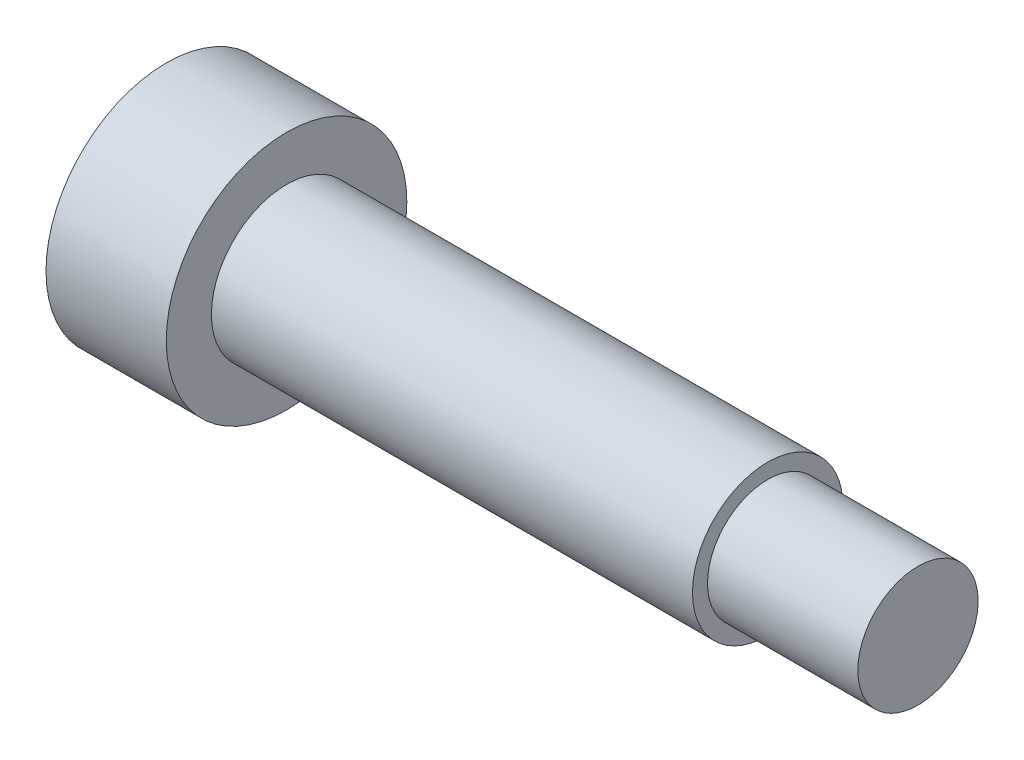
ISO-10303-21;
HEADER;
FILE_DESCRIPTION(('STEP AP214'),'2;1');
FILE_NAME('part.step','',(''),(''),'','','');
FILE_SCHEMA(('AUTOMOTIVE_DESIGN { 1 0 10303 214 1 1 1 1 }'));
ENDSEC;
DATA;
#1=APPLICATION_CONTEXT('core data for automotive mechanical design processes');
#2=APPLICATION_PROTOCOL_DEFINITION('international standard','automotive_design',2000,#1);
#3=PRODUCT_CONTEXT('',#1,'mechanical');
#4=PRODUCT('Part','Part','',(#3));
#5=PRODUCT_RELATED_PRODUCT_CATEGORY('part','',(#4));
#6=PRODUCT_DEFINITION_FORMATION('','',#4);
#7=PRODUCT_DEFINITION_CONTEXT('part definition',#1,'design');
#8=PRODUCT_DEFINITION('design','',#6,#7);
#9=PRODUCT_DEFINITION_SHAPE('','',#8);
#10=(LENGTH_UNIT() NAMED_UNIT(*) SI_UNIT(.MILLI.,.METRE.));
#11=(NAMED_UNIT(*) PLANE_ANGLE_UNIT() SI_UNIT($,.RADIAN.));
#12=(NAMED_UNIT(*) SI_UNIT($,.STERADIAN.) SOLID_ANGLE_UNIT());
#13=UNCERTAINTY_MEASURE_WITH_UNIT(LENGTH_MEASURE(1.E-05),#10,'distance_accuracy_value','');
#14=(GEOMETRIC_REPRESENTATION_CONTEXT(3) GLOBAL_UNCERTAINTY_ASSIGNED_CONTEXT((#13)) GLOBAL_UNIT_ASSIGNED_CONTEXT((#10,
#11,#12)) REPRESENTATION_CONTEXT('',''));
#15=CARTESIAN_POINT('',(0.,0.,0.));
#16=DIRECTION('',(0.,0.,1.));
#17=DIRECTION('',(1.,0.,0.));
#18=AXIS2_PLACEMENT_3D('',#15,#16,#17);
#19=CARTESIAN_POINT('',(0.,4.,0.));
#20=DIRECTION('',(1.,0.,0.));
#21=DIRECTION('',(0.,0.,-1.));
#22=AXIS2_PLACEMENT_3D('',#19,#20,#21);
#23=PLANE('',#22);
#24=DIRECTION('',(0.,-0.620623544845889,-0.784108675875305));
#25=VECTOR('',#24,1.);
#26=CARTESIAN_POINT('',(0.,1.42803230819687,-0.2098977371942));
#27=LINE('',#26,#25);
#28=CARTESIAN_POINT('',(0.,1.42803230819687,-0.2098977371942));
#29=VERTEX_POINT('',#28);
#30=CARTESIAN_POINT('',(0.,0.532239381491389,-1.34166112492052));
#31=VERTEX_POINT('',#30);
#32=EDGE_CURVE('E122',#29,#31,#27,.T.);
#33=ORIENTED_EDGE('',*,*,#32,.F.);
#34=DIRECTION('',(0.,0.368746260212848,-0.929530093960943));
#35=VECTOR('',#34,1.);
#36=CARTESIAN_POINT('',(0.,0.895792926705485,1.13176338772632));
#37=LINE('',#36,#35);
#38=CARTESIAN_POINT('',(0.,0.895792926705485,1.13176338772632));
#39=VERTEX_POINT('',#38);
#40=EDGE_CURVE('E48',#39,#29,#37,.T.);
#41=ORIENTED_EDGE('',*,*,#40,.F.);
#42=DIRECTION('',(0.,0.989369805058736,-0.145421418085638));
#43=VECTOR('',#42,1.);
#44=CARTESIAN_POINT('',(0.,-0.532239381491389,1.34166112492052));
#45=LINE('',#44,#43);
#46=CARTESIAN_POINT('',(0.,-0.532239381491389,1.34166112492052));
#47=VERTEX_POINT('',#46);
#48=EDGE_CURVE('E131',#47,#39,#45,.T.);
#49=ORIENTED_EDGE('',*,*,#48,.F.);
#50=DIRECTION('',(0.,0.620623544845888,0.784108675875305));
#51=VECTOR('',#50,1.);
#52=CARTESIAN_POINT('',(0.,-1.42803230819687,0.2098977371942));
#53=LINE('',#52,#51);
#54=CARTESIAN_POINT('',(0.,-1.42803230819687,0.2098977371942));
#55=VERTEX_POINT('',#54);
#56=EDGE_CURVE('E129',#55,#47,#53,.T.);
#57=ORIENTED_EDGE('',*,*,#56,.F.);
#58=DIRECTION('',(0.,-0.368746260212848,0.929530093960943));
#59=VECTOR('',#58,1.);
#60=CARTESIAN_POINT('',(0.,-0.895792926705483,-1.13176338772632));
#61=LINE('',#60,#59);
#62=CARTESIAN_POINT('',(0.,-0.895792926705483,-1.13176338772632));
#63=VERTEX_POINT('',#62);
#64=EDGE_CURVE('E96',#63,#55,#61,.T.);
#65=ORIENTED_EDGE('',*,*,#64,.F.);
#66=DIRECTION('',(0.,-0.989369805058736,0.145421418085638));
#67=VECTOR('',#66,1.);
#68=CARTESIAN_POINT('',(0.,0.532239381491389,-1.34166112492052));
#69=LINE('',#68,#67);
#70=EDGE_CURVE('E125',#31,#63,#69,.T.);
#71=ORIENTED_EDGE('',*,*,#70,.F.);
#72=EDGE_LOOP('',(#33,#41,#49,#57,#65,#71));
#73=FACE_BOUND('',#72,.T.);
#74=CARTESIAN_POINT('',(0.,0.,0.));
#75=DIRECTION('',(-1.,0.,0.));
#76=DIRECTION('',(0.,0.,1.));
#77=AXIS2_PLACEMENT_3D('',#74,#75,#76);
#78=CIRCLE('',#77,4.);
#79=CARTESIAN_POINT('',(0.,0.,4.));
#80=VERTEX_POINT('',#79);
#81=EDGE_CURVE('E135',#80,#80,#78,.T.);
#82=ORIENTED_EDGE('',*,*,#81,.T.);
#83=EDGE_LOOP('',(#82));
#84=FACE_BOUND('',#83,.T.);
#85=ADVANCED_FACE('F34',(#73,#84),#23,.F.);
#86=CARTESIAN_POINT('',(25.,0.,0.));
#87=DIRECTION('',(-1.,0.,0.));
#88=DIRECTION('',(0.,0.,1.));
#89=AXIS2_PLACEMENT_3D('',#86,#87,#88);
#90=PLANE('',#89);
#91=CARTESIAN_POINT('',(25.,0.,0.));
#92=DIRECTION('',(-1.,0.,0.));
#93=DIRECTION('',(0.,0.,1.));
#94=AXIS2_PLACEMENT_3D('',#91,#92,#93);
#95=CIRCLE('',#94,2.);
#96=CARTESIAN_POINT('',(25.,0.,2.));
#97=VERTEX_POINT('',#96);
#98=EDGE_CURVE('E11',#97,#97,#95,.T.);
#99=ORIENTED_EDGE('',*,*,#98,.F.);
#100=EDGE_LOOP('',(#99));
#101=FACE_BOUND('',#100,.T.);
#102=ADVANCED_FACE('F159',(#101),#90,.F.);
#103=CARTESIAN_POINT('',(0.,0.,0.));
#104=DIRECTION('',(-1.,0.,0.));
#105=DIRECTION('',(0.,0.,1.));
#106=AXIS2_PLACEMENT_3D('',#103,#104,#105);
#107=CYLINDRICAL_SURFACE('',#106,2.);
#108=CARTESIAN_POINT('',(20.,0.,0.));
#109=DIRECTION('',(-1.,0.,0.));
#110=DIRECTION('',(0.,0.,1.));
#111=AXIS2_PLACEMENT_3D('',#108,#109,#110);
#112=CIRCLE('',#111,2.);
#113=CARTESIAN_POINT('',(20.,0.,2.));
#114=VERTEX_POINT('',#113);
#115=EDGE_CURVE('E41',#114,#114,#112,.T.);
#116=ORIENTED_EDGE('',*,*,#115,.F.);
#117=EDGE_LOOP('',(#116));
#118=FACE_BOUND('',#117,.T.);
#119=ORIENTED_EDGE('',*,*,#98,.T.);
#120=EDGE_LOOP('',(#119));
#121=FACE_BOUND('',#120,.T.);
#122=ADVANCED_FACE('F156',(#118,#121),#107,.T.);
#123=CARTESIAN_POINT('',(20.,2.,0.));
#124=DIRECTION('',(-1.,0.,0.));
#125=DIRECTION('',(0.,0.,1.));
#126=AXIS2_PLACEMENT_3D('',#123,#124,#125);
#127=PLANE('',#126);
#128=CARTESIAN_POINT('',(20.,0.,0.));
#129=DIRECTION('',(-1.,0.,0.));
#130=DIRECTION('',(0.,0.,1.));
#131=AXIS2_PLACEMENT_3D('',#128,#129,#130);
#132=CIRCLE('',#131,2.5);
#133=CARTESIAN_POINT('',(20.,0.,2.5));
#134=VERTEX_POINT('',#133);
#135=EDGE_CURVE('E149',#134,#134,#132,.T.);
#136=ORIENTED_EDGE('',*,*,#135,.F.);
#137=EDGE_LOOP('',(#136));
#138=FACE_BOUND('',#137,.T.);
#139=ORIENTED_EDGE('',*,*,#115,.T.);
#140=EDGE_LOOP('',(#139));
#141=FACE_BOUND('',#140,.T.);
#142=ADVANCED_FACE('F154',(#138,#141),#127,.F.);
#143=CARTESIAN_POINT('',(0.,0.,0.));
#144=DIRECTION('',(-1.,0.,0.));
#145=DIRECTION('',(0.,0.,1.));
#146=AXIS2_PLACEMENT_3D('',#143,#144,#145);
#147=CYLINDRICAL_SURFACE('',#146,2.5);
#148=CARTESIAN_POINT('',(4.,0.,0.));
#149=DIRECTION('',(-1.,0.,0.));
#150=DIRECTION('',(0.,0.,1.));
#151=AXIS2_PLACEMENT_3D('',#148,#149,#150);
#152=CIRCLE('',#151,2.5);
#153=CARTESIAN_POINT('',(4.,0.,2.5));
#154=VERTEX_POINT('',#153);
#155=EDGE_CURVE('E146',#154,#154,#152,.T.);
#156=ORIENTED_EDGE('',*,*,#155,.F.);
#157=EDGE_LOOP('',(#156));
#158=FACE_BOUND('',#157,.T.);
#159=ORIENTED_EDGE('',*,*,#135,.T.);
#160=EDGE_LOOP('',(#159));
#161=FACE_BOUND('',#160,.T.);
#162=ADVANCED_FACE('F173',(#158,#161),#147,.T.);
#163=CARTESIAN_POINT('',(4.,2.5,0.));
#164=DIRECTION('',(-1.,0.,0.));
#165=DIRECTION('',(0.,0.,1.));
#166=AXIS2_PLACEMENT_3D('',#163,#164,#165);
#167=PLANE('',#166);
#168=CARTESIAN_POINT('',(4.,0.,0.));
#169=DIRECTION('',(-1.,0.,0.));
#170=DIRECTION('',(0.,0.,1.));
#171=AXIS2_PLACEMENT_3D('',#168,#169,#170);
#172=CIRCLE('',#171,4.);
#173=CARTESIAN_POINT('',(4.,0.,4.));
#174=VERTEX_POINT('',#173);
#175=EDGE_CURVE('E143',#174,#174,#172,.T.);
#176=ORIENTED_EDGE('',*,*,#175,.F.);
#177=EDGE_LOOP('',(#176));
#178=FACE_BOUND('',#177,.T.);
#179=ORIENTED_EDGE('',*,*,#155,.T.);
#180=EDGE_LOOP('',(#179));
#181=FACE_BOUND('',#180,.T.);
#182=ADVANCED_FACE('F177',(#178,#181),#167,.F.);
#183=CARTESIAN_POINT('',(0.,0.,0.));
#184=DIRECTION('',(-1.,0.,0.));
#185=DIRECTION('',(0.,0.,1.));
#186=AXIS2_PLACEMENT_3D('',#183,#184,#185);
#187=CYLINDRICAL_SURFACE('',#186,4.);
#188=ORIENTED_EDGE('',*,*,#81,.F.);
#189=EDGE_LOOP('',(#188));
#190=FACE_BOUND('',#189,.T.);
#191=ORIENTED_EDGE('',*,*,#175,.T.);
#192=EDGE_LOOP('',(#191));
#193=FACE_BOUND('',#192,.T.);
#194=ADVANCED_FACE('F181',(#190,#193),#187,.T.);
#195=CARTESIAN_POINT('',(1.5,0.895792926705485,1.13176338772632));
#196=DIRECTION('',(0.,0.929530093960942,0.368746260212848));
#197=DIRECTION('',(0.,-0.368746260212848,0.929530093960943));
#198=AXIS2_PLACEMENT_3D('',#195,#196,#197);
#199=PLANE('',#198);
#200=ORIENTED_EDGE('',*,*,#40,.T.);
#201=DIRECTION('',(-1.,0.,0.));
#202=VECTOR('',#201,1.);
#203=CARTESIAN_POINT('',(1.5,1.42803230819687,-0.2098977371942));
#204=LINE('',#203,#202);
#205=CARTESIAN_POINT('',(1.5,1.42803230819687,-0.2098977371942));
#206=VERTEX_POINT('',#205);
#207=EDGE_CURVE('E78',#206,#29,#204,.T.);
#208=ORIENTED_EDGE('',*,*,#207,.F.);
#209=DIRECTION('',(0.,0.368746260212848,-0.929530093960943));
#210=VECTOR('',#209,1.);
#211=CARTESIAN_POINT('',(1.5,0.895792926705485,1.13176338772632));
#212=LINE('',#211,#210);
#213=CARTESIAN_POINT('',(1.5,0.895792926705485,1.13176338772632));
#214=VERTEX_POINT('',#213);
#215=EDGE_CURVE('E133',#214,#206,#212,.T.);
#216=ORIENTED_EDGE('',*,*,#215,.F.);
#217=DIRECTION('',(-1.,0.,0.));
#218=VECTOR('',#217,1.);
#219=CARTESIAN_POINT('',(1.5,0.895792926705485,1.13176338772632));
#220=LINE('',#219,#218);
#221=EDGE_CURVE('E56',#214,#39,#220,.T.);
#222=ORIENTED_EDGE('',*,*,#221,.T.);
#223=EDGE_LOOP('',(#200,#208,#216,#222));
#224=FACE_BOUND('',#223,.T.);
#225=ADVANCED_FACE('F185',(#224),#199,.F.);
#226=CARTESIAN_POINT('',(1.5,-0.532239381491389,1.34166112492052));
#227=DIRECTION('',(0.,0.145421418085638,0.989369805058736));
#228=DIRECTION('',(0.,-0.989369805058737,0.145421418085638));
#229=AXIS2_PLACEMENT_3D('',#226,#227,#228);
#230=PLANE('',#229);
#231=ORIENTED_EDGE('',*,*,#48,.T.);
#232=ORIENTED_EDGE('',*,*,#221,.F.);
#233=DIRECTION('',(0.,0.989369805058736,-0.145421418085638));
#234=VECTOR('',#233,1.);
#235=CARTESIAN_POINT('',(1.5,-0.532239381491389,1.34166112492052));
#236=LINE('',#235,#234);
#237=CARTESIAN_POINT('',(1.5,-0.532239381491389,1.34166112492052));
#238=VERTEX_POINT('',#237);
#239=EDGE_CURVE('E108',#238,#214,#236,.T.);
#240=ORIENTED_EDGE('',*,*,#239,.F.);
#241=DIRECTION('',(-1.,0.,0.));
#242=VECTOR('',#241,1.);
#243=CARTESIAN_POINT('',(1.5,-0.532239381491389,1.34166112492052));
#244=LINE('',#243,#242);
#245=EDGE_CURVE('E100',#238,#47,#244,.T.);
#246=ORIENTED_EDGE('',*,*,#245,.T.);
#247=EDGE_LOOP('',(#231,#232,#240,#246));
#248=FACE_BOUND('',#247,.T.);
#249=ADVANCED_FACE('F189',(#248),#230,.F.);
#250=CARTESIAN_POINT('',(1.5,-1.42803230819687,0.2098977371942));
#251=DIRECTION('',(0.,-0.784108675875305,0.620623544845888));
#252=DIRECTION('',(0.,-0.620623544845888,-0.784108675875305));
#253=AXIS2_PLACEMENT_3D('',#250,#251,#252);
#254=PLANE('',#253);
#255=ORIENTED_EDGE('',*,*,#56,.T.);
#256=ORIENTED_EDGE('',*,*,#245,.F.);
#257=DIRECTION('',(0.,0.620623544845888,0.784108675875305));
#258=VECTOR('',#257,1.);
#259=CARTESIAN_POINT('',(1.5,-1.42803230819687,0.2098977371942));
#260=LINE('',#259,#258);
#261=CARTESIAN_POINT('',(1.5,-1.42803230819687,0.2098977371942));
#262=VERTEX_POINT('',#261);
#263=EDGE_CURVE('E104',#262,#238,#260,.T.);
#264=ORIENTED_EDGE('',*,*,#263,.F.);
#265=DIRECTION('',(-1.,0.,0.));
#266=VECTOR('',#265,1.);
#267=CARTESIAN_POINT('',(1.5,-1.42803230819687,0.2098977371942));
#268=LINE('',#267,#266);
#269=EDGE_CURVE('E89',#262,#55,#268,.T.);
#270=ORIENTED_EDGE('',*,*,#269,.T.);
#271=EDGE_LOOP('',(#255,#256,#264,#270));
#272=FACE_BOUND('',#271,.T.);
#273=ADVANCED_FACE('F105',(#272),#254,.F.);
#274=CARTESIAN_POINT('',(1.5,-0.895792926705483,-1.13176338772632));
#275=DIRECTION('',(0.,-0.929530093960943,-0.368746260212848));
#276=DIRECTION('',(0.,0.368746260212848,-0.929530093960943));
#277=AXIS2_PLACEMENT_3D('',#274,#275,#276);
#278=PLANE('',#277);
#279=ORIENTED_EDGE('',*,*,#64,.T.);
#280=ORIENTED_EDGE('',*,*,#269,.F.);
#281=DIRECTION('',(0.,-0.368746260212848,0.929530093960943));
#282=VECTOR('',#281,1.);
#283=CARTESIAN_POINT('',(1.5,-0.895792926705483,-1.13176338772632));
#284=LINE('',#283,#282);
#285=CARTESIAN_POINT('',(1.5,-0.895792926705483,-1.13176338772632));
#286=VERTEX_POINT('',#285);
#287=EDGE_CURVE('E93',#286,#262,#284,.T.);
#288=ORIENTED_EDGE('',*,*,#287,.F.);
#289=DIRECTION('',(-1.,0.,0.));
#290=VECTOR('',#289,1.);
#291=CARTESIAN_POINT('',(1.5,-0.895792926705483,-1.13176338772632));
#292=LINE('',#291,#290);
#293=EDGE_CURVE('E101',#286,#63,#292,.T.);
#294=ORIENTED_EDGE('',*,*,#293,.T.);
#295=EDGE_LOOP('',(#279,#280,#288,#294));
#296=FACE_BOUND('',#295,.T.);
#297=ADVANCED_FACE('F91',(#296),#278,.F.);
#298=CARTESIAN_POINT('',(1.5,0.532239381491389,-1.34166112492052));
#299=DIRECTION('',(0.,-0.145421418085638,-0.989369805058736));
#300=DIRECTION('',(0.,0.989369805058736,-0.145421418085638));
#301=AXIS2_PLACEMENT_3D('',#298,#299,#300);
#302=PLANE('',#301);
#303=ORIENTED_EDGE('',*,*,#70,.T.);
#304=ORIENTED_EDGE('',*,*,#293,.F.);
#305=DIRECTION('',(0.,-0.989369805058736,0.145421418085638));
#306=VECTOR('',#305,1.);
#307=CARTESIAN_POINT('',(1.5,0.532239381491389,-1.34166112492052));
#308=LINE('',#307,#306);
#309=CARTESIAN_POINT('',(1.5,0.532239381491389,-1.34166112492052));
#310=VERTEX_POINT('',#309);
#311=EDGE_CURVE('E114',#310,#286,#308,.T.);
#312=ORIENTED_EDGE('',*,*,#311,.F.);
#313=DIRECTION('',(-1.,0.,0.));
#314=VECTOR('',#313,1.);
#315=CARTESIAN_POINT('',(1.5,0.532239381491389,-1.34166112492052));
#316=LINE('',#315,#314);
#317=EDGE_CURVE('E138',#310,#31,#316,.T.);
#318=ORIENTED_EDGE('',*,*,#317,.T.);
#319=EDGE_LOOP('',(#303,#304,#312,#318));
#320=FACE_BOUND('',#319,.T.);
#321=ADVANCED_FACE('F193',(#320),#302,.F.);
#322=CARTESIAN_POINT('',(1.5,1.42803230819687,-0.2098977371942));
#323=DIRECTION('',(0.,0.784108675875304,-0.620623544845888));
#324=DIRECTION('',(0.,0.620623544845889,0.784108675875305));
#325=AXIS2_PLACEMENT_3D('',#322,#323,#324);
#326=PLANE('',#325);
#327=ORIENTED_EDGE('',*,*,#32,.T.);
#328=ORIENTED_EDGE('',*,*,#317,.F.);
#329=DIRECTION('',(0.,-0.620623544845889,-0.784108675875305));
#330=VECTOR('',#329,1.);
#331=CARTESIAN_POINT('',(1.5,1.42803230819687,-0.2098977371942));
#332=LINE('',#331,#330);
#333=EDGE_CURVE('E116',#206,#310,#332,.T.);
#334=ORIENTED_EDGE('',*,*,#333,.F.);
#335=ORIENTED_EDGE('',*,*,#207,.T.);
#336=EDGE_LOOP('',(#327,#328,#334,#335));
#337=FACE_BOUND('',#336,.T.);
#338=ADVANCED_FACE('F190',(#337),#326,.F.);
#339=CARTESIAN_POINT('',(1.5,0.,0.));
#340=DIRECTION('',(-1.,0.,0.));
#341=DIRECTION('',(0.,0.,1.));
#342=AXIS2_PLACEMENT_3D('',#339,#340,#341);
#343=PLANE('',#342);
#344=ORIENTED_EDGE('',*,*,#215,.T.);
#345=ORIENTED_EDGE('',*,*,#333,.T.);
#346=ORIENTED_EDGE('',*,*,#311,.T.);
#347=ORIENTED_EDGE('',*,*,#287,.T.);
#348=ORIENTED_EDGE('',*,*,#263,.T.);
#349=ORIENTED_EDGE('',*,*,#239,.T.);
#350=EDGE_LOOP('',(#344,#345,#346,#347,#348,#349));
#351=FACE_BOUND('',#350,.T.);
#352=ADVANCED_FACE('F111',(#351),#343,.T.);
#353=CLOSED_SHELL('',(#85,#102,#122,#142,#162,#182,#194,#225,#249,#273,#297,#321,#338,#352));
#354=MANIFOLD_SOLID_BREP('B2',#353);
#355=ADVANCED_BREP_SHAPE_REPRESENTATION('',(#18,#354),#14);
#356=SHAPE_DEFINITION_REPRESENTATION(#9,#355);
ENDSEC;
END-ISO-10303-21;
